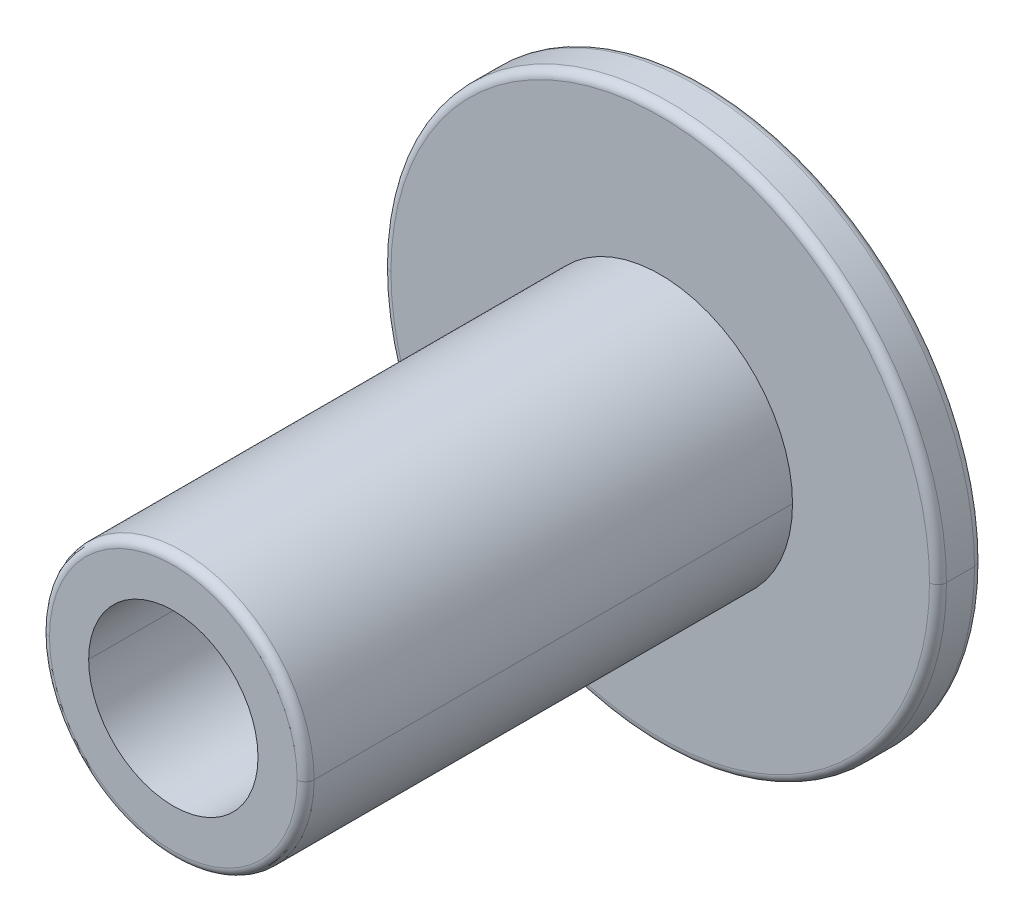
ISO-10303-21;
HEADER;
FILE_DESCRIPTION(('STEP AP214'),'2;1');
FILE_NAME('part.step','',(''),(''),'','','');
FILE_SCHEMA(('AUTOMOTIVE_DESIGN { 1 0 10303 214 1 1 1 1 }'));
ENDSEC;
DATA;
#1=APPLICATION_CONTEXT('core data for automotive mechanical design processes');
#2=APPLICATION_PROTOCOL_DEFINITION('international standard','automotive_design',2000,#1);
#3=PRODUCT_CONTEXT('',#1,'mechanical');
#4=PRODUCT('Part','Part','',(#3));
#5=PRODUCT_RELATED_PRODUCT_CATEGORY('part','',(#4));
#6=PRODUCT_DEFINITION_FORMATION('','',#4);
#7=PRODUCT_DEFINITION_CONTEXT('part definition',#1,'design');
#8=PRODUCT_DEFINITION('design','',#6,#7);
#9=PRODUCT_DEFINITION_SHAPE('','',#8);
#10=(LENGTH_UNIT() NAMED_UNIT(*) SI_UNIT(.MILLI.,.METRE.));
#11=(NAMED_UNIT(*) PLANE_ANGLE_UNIT() SI_UNIT($,.RADIAN.));
#12=(NAMED_UNIT(*) SI_UNIT($,.STERADIAN.) SOLID_ANGLE_UNIT());
#13=UNCERTAINTY_MEASURE_WITH_UNIT(LENGTH_MEASURE(1.E-05),#10,'distance_accuracy_value','');
#14=(GEOMETRIC_REPRESENTATION_CONTEXT(3) GLOBAL_UNCERTAINTY_ASSIGNED_CONTEXT((#13)) GLOBAL_UNIT_ASSIGNED_CONTEXT((#10,
#11,#12)) REPRESENTATION_CONTEXT('',''));
#15=CARTESIAN_POINT('',(0.,0.,0.));
#16=DIRECTION('',(0.,0.,1.));
#17=DIRECTION('',(1.,0.,0.));
#18=AXIS2_PLACEMENT_3D('',#15,#16,#17);
#19=CARTESIAN_POINT('',(4.55191440096314E-12,-6.10622663543836E-13,1.58750000000153));
#20=DIRECTION('',(0.,0.,-1.));
#21=DIRECTION('',(-1.,0.,0.));
#22=AXIS2_PLACEMENT_3D('',#19,#20,#21);
#23=TOROIDAL_SURFACE('',#22,2.24094461987932,1.5875);
#24=CARTESIAN_POINT('',(3.5527136788005E-12,-2.58126853225349E-12,0.108811457704222));
#25=DIRECTION('',(0.,0.,1.));
#26=DIRECTION('',(-1.,-9.11215547461094E-13,0.));
#27=AXIS2_PLACEMENT_3D('',#24,#25,#26);
#28=CIRCLE('',#27,2.81855733171483);
#29=CARTESIAN_POINT('',(2.81855733171838,0.,0.10881145770423));
#30=VERTEX_POINT('',#29);
#31=CARTESIAN_POINT('',(-2.81855733171128,0.,0.108811457704214));
#32=VERTEX_POINT('',#31);
#33=EDGE_CURVE('E162',#30,#32,#28,.T.);
#34=ORIENTED_EDGE('',*,*,#33,.F.);
#35=CARTESIAN_POINT('',(2.24094461988388,-6.2241477630067E-13,1.58750000000152));
#36=DIRECTION('',(0.,1.,0.));
#37=DIRECTION('',(-1.,0.,0.));
#38=AXIS2_PLACEMENT_3D('',#35,#36,#37);
#39=CIRCLE('',#38,1.5875);
#40=CARTESIAN_POINT('',(2.24094461987932,-6.20700563749015E-13,0.));
#41=VERTEX_POINT('',#40);
#42=EDGE_CURVE('E11',#30,#41,#39,.T.);
#43=ORIENTED_EDGE('',*,*,#42,.T.);
#44=CARTESIAN_POINT('',(0.,0.,0.));
#45=DIRECTION('',(0.,0.,-1.));
#46=DIRECTION('',(-1.,0.,0.));
#47=AXIS2_PLACEMENT_3D('',#44,#45,#46);
#48=CIRCLE('',#47,2.24094461987933);
#49=CARTESIAN_POINT('',(-2.24094461987933,0.,0.));
#50=VERTEX_POINT('',#49);
#51=EDGE_CURVE('E20',#50,#41,#48,.T.);
#52=ORIENTED_EDGE('',*,*,#51,.F.);
#53=CARTESIAN_POINT('',(-2.24094461987478,-5.98556114221422E-13,1.58750000000154));
#54=DIRECTION('',(0.,-1.,0.));
#55=DIRECTION('',(1.,0.,0.));
#56=AXIS2_PLACEMENT_3D('',#53,#54,#55);
#57=CIRCLE('',#56,1.5875);
#58=EDGE_CURVE('E232',#32,#50,#57,.T.);
#59=ORIENTED_EDGE('',*,*,#58,.F.);
#60=EDGE_LOOP('',(#34,#43,#52,#59));
#61=FACE_BOUND('',#60,.T.);
#62=ADVANCED_FACE('F16',(#61),#23,.T.);
#63=CARTESIAN_POINT('',(3.5527136788005E-12,-2.83106871279415E-12,0.721736105630408));
#64=DIRECTION('',(0.,0.,1.));
#65=DIRECTION('',(1.,0.,0.));
#66=AXIS2_PLACEMENT_3D('',#63,#64,#65);
#67=TOROIDAL_SURFACE('',#66,4.0386,0.127);
#68=CARTESIAN_POINT('',(3.66373598126302E-12,-1.38777878078145E-12,0.603441022247617));
#69=DIRECTION('',(0.,0.,-1.));
#70=DIRECTION('',(-1.,0.,0.));
#71=AXIS2_PLACEMENT_3D('',#68,#69,#70);
#72=CIRCLE('',#71,4.08480901694686);
#73=CARTESIAN_POINT('',(-4.08480901695387,0.,0.603441022247605));
#74=VERTEX_POINT('',#73);
#75=CARTESIAN_POINT('',(4.08480901695398,0.,0.603441022247628));
#76=VERTEX_POINT('',#75);
#77=EDGE_CURVE('E165',#74,#76,#72,.T.);
#78=ORIENTED_EDGE('',*,*,#77,.F.);
#79=CARTESIAN_POINT('',(-4.03859999999646,-2.80882795540768E-12,0.721736105630418));
#80=DIRECTION('',(0.,1.,0.));
#81=DIRECTION('',(-1.,0.,0.));
#82=AXIS2_PLACEMENT_3D('',#79,#80,#81);
#83=CIRCLE('',#82,0.127);
#84=CARTESIAN_POINT('',(-4.16559999999645,-8.44283687993035E-13,0.721736105630396));
#85=VERTEX_POINT('',#84);
#86=EDGE_CURVE('E27',#74,#85,#83,.T.);
#87=ORIENTED_EDGE('',*,*,#86,.T.);
#88=CARTESIAN_POINT('',(3.5527136788005E-12,-2.83106871279415E-12,0.721736105630408));
#89=DIRECTION('',(0.,0.,1.));
#90=DIRECTION('',(1.,0.,0.));
#91=AXIS2_PLACEMENT_3D('',#88,#89,#90);
#92=CIRCLE('',#91,4.1656);
#93=CARTESIAN_POINT('',(4.16560000000356,-8.88633575927774E-13,0.721736105630419));
#94=VERTEX_POINT('',#93);
#95=EDGE_CURVE('E141',#94,#85,#92,.T.);
#96=ORIENTED_EDGE('',*,*,#95,.F.);
#97=CARTESIAN_POINT('',(4.03860000000356,-2.85281488432432E-12,0.721736105630397));
#98=DIRECTION('',(0.,-1.,0.));
#99=DIRECTION('',(1.,0.,0.));
#100=AXIS2_PLACEMENT_3D('',#97,#98,#99);
#101=CIRCLE('',#100,0.127);
#102=EDGE_CURVE('E228',#76,#94,#101,.T.);
#103=ORIENTED_EDGE('',*,*,#102,.F.);
#104=EDGE_LOOP('',(#78,#87,#96,#103));
#105=FACE_BOUND('',#104,.T.);
#106=ADVANCED_FACE('F293',(#105),#67,.T.);
#107=CARTESIAN_POINT('',(2.66453525910038E-12,-2.99760216648793E-12,1.14300000000254));
#108=DIRECTION('',(0.,0.,1.));
#109=DIRECTION('',(1.,0.,0.));
#110=AXIS2_PLACEMENT_3D('',#107,#108,#109);
#111=TOROIDAL_SURFACE('',#110,4.0386,0.127);
#112=CARTESIAN_POINT('',(2.66453525910038E-12,-2.99760216648793E-12,1.14300000000254));
#113=DIRECTION('',(0.,0.,-1.));
#114=DIRECTION('',(1.,-5.16975351416703E-13,0.));
#115=AXIS2_PLACEMENT_3D('',#112,#113,#114);
#116=CIRCLE('',#115,4.1656);
#117=CARTESIAN_POINT('',(-4.16559999999734,-8.4428368799252E-13,1.14300000000253));
#118=VERTEX_POINT('',#117);
#119=CARTESIAN_POINT('',(4.16560000000267,-8.88633575928028E-13,1.14300000000256));
#120=VERTEX_POINT('',#119);
#121=EDGE_CURVE('E120',#118,#120,#116,.T.);
#122=ORIENTED_EDGE('',*,*,#121,.F.);
#123=CARTESIAN_POINT('',(-4.03859999999735,-2.97536140910145E-12,1.14300000000256));
#124=DIRECTION('',(0.,1.,0.));
#125=DIRECTION('',(-1.,0.,0.));
#126=AXIS2_PLACEMENT_3D('',#123,#124,#125);
#127=CIRCLE('',#126,0.127);
#128=CARTESIAN_POINT('',(-4.03859999999739,-2.97514566006296E-12,1.2700000000022));
#129=VERTEX_POINT('',#128);
#130=EDGE_CURVE('E117',#118,#129,#127,.T.);
#131=ORIENTED_EDGE('',*,*,#130,.T.);
#132=CARTESIAN_POINT('',(2.60902410786912E-12,-1.55431223447522E-12,1.27000000000221));
#133=DIRECTION('',(0.,0.,1.));
#134=DIRECTION('',(1.,0.,0.));
#135=AXIS2_PLACEMENT_3D('',#132,#133,#134);
#136=CIRCLE('',#135,4.0386);
#137=CARTESIAN_POINT('',(4.03860000000262,-1.57605840600539E-12,1.2700000000022));
#138=VERTEX_POINT('',#137);
#139=EDGE_CURVE('E106',#138,#129,#136,.T.);
#140=ORIENTED_EDGE('',*,*,#139,.F.);
#141=CARTESIAN_POINT('',(4.03860000000267,-3.01934833801809E-12,1.14300000000253));
#142=DIRECTION('',(0.,-1.,0.));
#143=DIRECTION('',(1.,0.,0.));
#144=AXIS2_PLACEMENT_3D('',#141,#142,#143);
#145=CIRCLE('',#144,0.127);
#146=EDGE_CURVE('E128',#120,#138,#145,.T.);
#147=ORIENTED_EDGE('',*,*,#146,.F.);
#148=EDGE_LOOP('',(#122,#131,#140,#147));
#149=FACE_BOUND('',#148,.T.);
#150=ADVANCED_FACE('F118',(#149),#111,.T.);
#151=CARTESIAN_POINT('',(4.77395900588817E-12,-2.66453525910038E-12,8.44550000000213));
#152=DIRECTION('',(0.,0.,1.));
#153=DIRECTION('',(1.,0.,0.));
#154=AXIS2_PLACEMENT_3D('',#151,#152,#153);
#155=TOROIDAL_SURFACE('',#154,1.857375,0.127);
#156=CARTESIAN_POINT('',(4.77395900588817E-12,-2.66453525910038E-12,8.44550000000213));
#157=DIRECTION('',(0.,0.,-1.));
#158=DIRECTION('',(1.,-9.06885677665056E-13,0.));
#159=AXIS2_PLACEMENT_3D('',#156,#157,#158);
#160=CIRCLE('',#159,1.984375);
#161=CARTESIAN_POINT('',(-1.98437499999523,-8.64308965840754E-13,8.44550000000213));
#162=VERTEX_POINT('',#161);
#163=CARTESIAN_POINT('',(1.98437500000477,-8.8543600849238E-13,8.44550000000214));
#164=VERTEX_POINT('',#163);
#165=EDGE_CURVE('E153',#162,#164,#160,.T.);
#166=ORIENTED_EDGE('',*,*,#165,.F.);
#167=CARTESIAN_POINT('',(-1.85737499999523,-2.65430660888726E-12,8.44550000000214));
#168=DIRECTION('',(0.,1.,0.));
#169=DIRECTION('',(-1.,0.,0.));
#170=AXIS2_PLACEMENT_3D('',#167,#168,#169);
#171=CIRCLE('',#170,0.127);
#172=CARTESIAN_POINT('',(-1.85737499999606,-2.65409085984877E-12,8.57250000000193));
#173=VERTEX_POINT('',#172);
#174=EDGE_CURVE('E125',#162,#173,#171,.T.);
#175=ORIENTED_EDGE('',*,*,#174,.T.);
#176=CARTESIAN_POINT('',(3.9412917374193E-12,-1.97064586870965E-12,8.57250000000194));
#177=DIRECTION('',(0.,0.,1.));
#178=DIRECTION('',(1.,0.,0.));
#179=AXIS2_PLACEMENT_3D('',#176,#177,#178);
#180=CIRCLE('',#179,1.857375);
#181=CARTESIAN_POINT('',(1.85737500000395,-1.98064705608792E-12,8.57250000000193));
#182=VERTEX_POINT('',#181);
#183=EDGE_CURVE('E182',#182,#173,#180,.T.);
#184=ORIENTED_EDGE('',*,*,#183,.F.);
#185=CARTESIAN_POINT('',(1.85737500000478,-2.67453644647864E-12,8.44550000000213));
#186=DIRECTION('',(0.,-1.,0.));
#187=DIRECTION('',(1.,0.,0.));
#188=AXIS2_PLACEMENT_3D('',#185,#186,#187);
#189=CIRCLE('',#188,0.127);
#190=EDGE_CURVE('E206',#164,#182,#189,.T.);
#191=ORIENTED_EDGE('',*,*,#190,.F.);
#192=EDGE_LOOP('',(#166,#175,#184,#191));
#193=FACE_BOUND('',#192,.T.);
#194=ADVANCED_FACE('F339',(#193),#155,.T.);
#195=CARTESIAN_POINT('',(5.10702591327572E-12,-7.7715611723761E-13,-41.5235806157101));
#196=DIRECTION('',(0.,0.,-1.));
#197=DIRECTION('',(-1.,0.,0.));
#198=AXIS2_PLACEMENT_3D('',#195,#196,#197);
#199=CYLINDRICAL_SURFACE('',#198,1.984375);
#200=ORIENTED_EDGE('',*,*,#165,.T.);
#201=DIRECTION('',(0.,0.,-1.));
#202=VECTOR('',#201,1.);
#203=CARTESIAN_POINT('',(1.98437500000511,-7.87598130638683E-13,-41.5235806157101));
#204=LINE('',#203,#202);
#205=CARTESIAN_POINT('',(1.98437500000261,-8.85436008492686E-13,1.27000000000222));
#206=VERTEX_POINT('',#205);
#207=EDGE_CURVE('E144',#164,#206,#204,.T.);
#208=ORIENTED_EDGE('',*,*,#207,.T.);
#209=CARTESIAN_POINT('',(2.60902410786912E-12,-1.55431223447522E-12,1.27000000000221));
#210=DIRECTION('',(0.,0.,-1.));
#211=DIRECTION('',(-1.,0.,0.));
#212=AXIS2_PLACEMENT_3D('',#209,#210,#211);
#213=CIRCLE('',#212,1.984375);
#214=CARTESIAN_POINT('',(-1.98437499999739,-1.54362720522494E-12,1.27000000000222));
#215=VERTEX_POINT('',#214);
#216=EDGE_CURVE('E130',#215,#206,#213,.T.);
#217=ORIENTED_EDGE('',*,*,#216,.F.);
#218=DIRECTION('',(0.,0.,-1.));
#219=VECTOR('',#218,1.);
#220=CARTESIAN_POINT('',(-1.9843749999949,-7.6647108798733E-13,-41.52358061571));
#221=LINE('',#220,#219);
#222=EDGE_CURVE('E217',#162,#215,#221,.T.);
#223=ORIENTED_EDGE('',*,*,#222,.F.);
#224=EDGE_LOOP('',(#200,#208,#217,#223));
#225=FACE_BOUND('',#224,.T.);
#226=ADVANCED_FACE('F336',(#225),#199,.T.);
#227=CARTESIAN_POINT('',(5.10702591327572E-12,-7.7715611723761E-13,-41.5235806157101));
#228=DIRECTION('',(0.,0.,-1.));
#229=DIRECTION('',(-1.,0.,0.));
#230=AXIS2_PLACEMENT_3D('',#227,#228,#229);
#231=CYLINDRICAL_SURFACE('',#230,4.1656);
#232=ORIENTED_EDGE('',*,*,#121,.T.);
#233=DIRECTION('',(0.,0.,-1.));
#234=VECTOR('',#233,1.);
#235=CARTESIAN_POINT('',(4.16560000000512,-7.99075991769143E-13,-41.5235806157101));
#236=LINE('',#235,#234);
#237=EDGE_CURVE('E145',#120,#94,#236,.T.);
#238=ORIENTED_EDGE('',*,*,#237,.T.);
#239=ORIENTED_EDGE('',*,*,#95,.T.);
#240=DIRECTION('',(0.,0.,-1.));
#241=VECTOR('',#240,1.);
#242=CARTESIAN_POINT('',(-4.1655999999949,-7.54726103835424E-13,-41.52358061571));
#243=LINE('',#242,#241);
#244=EDGE_CURVE('E178',#118,#85,#243,.T.);
#245=ORIENTED_EDGE('',*,*,#244,.F.);
#246=EDGE_LOOP('',(#232,#238,#239,#245));
#247=FACE_BOUND('',#246,.T.);
#248=ADVANCED_FACE('F18',(#247),#231,.T.);
#249=CARTESIAN_POINT('',(0.,0.,0.));
#250=DIRECTION('',(0.,0.,1.));
#251=DIRECTION('',(1.,0.,0.));
#252=AXIS2_PLACEMENT_3D('',#249,#250,#251);
#253=CONICAL_SURFACE('',#252,2.54,1.19839788011814);
#254=ORIENTED_EDGE('',*,*,#33,.T.);
#255=DIRECTION('',(-0.93145734947962,0.,0.363850527140475));
#256=VECTOR('',#255,1.);
#257=CARTESIAN_POINT('',(-2.54,0.,0.));
#258=LINE('',#257,#256);
#259=EDGE_CURVE('E185',#32,#74,#258,.T.);
#260=ORIENTED_EDGE('',*,*,#259,.T.);
#261=ORIENTED_EDGE('',*,*,#77,.T.);
#262=DIRECTION('',(0.931457349479621,0.,0.363850527140471));
#263=VECTOR('',#262,1.);
#264=CARTESIAN_POINT('',(2.54,0.,0.));
#265=LINE('',#264,#263);
#266=EDGE_CURVE('E42',#30,#76,#265,.T.);
#267=ORIENTED_EDGE('',*,*,#266,.F.);
#268=EDGE_LOOP('',(#254,#260,#261,#267));
#269=FACE_BOUND('',#268,.T.);
#270=ADVANCED_FACE('F315',(#269),#253,.T.);
#271=CARTESIAN_POINT('',(5.10702591327572E-12,-7.7715611723761E-13,-41.5235806157101));
#272=DIRECTION('',(0.,0.,-1.));
#273=DIRECTION('',(-1.,0.,0.));
#274=AXIS2_PLACEMENT_3D('',#271,#272,#273);
#275=CYLINDRICAL_SURFACE('',#274,1.27);
#276=CARTESIAN_POINT('',(3.9412917374193E-12,-1.97064586870965E-12,8.57250000000194));
#277=DIRECTION('',(0.,0.,-1.));
#278=DIRECTION('',(-1.,0.,0.));
#279=AXIS2_PLACEMENT_3D('',#276,#277,#278);
#280=CIRCLE('',#279,1.27);
#281=CARTESIAN_POINT('',(1.27000000000394,-8.80471348026068E-13,8.57250000000194));
#282=VERTEX_POINT('',#281);
#283=CARTESIAN_POINT('',(-1.26999999999606,-1.96380744998947E-12,8.57250000000194));
#284=VERTEX_POINT('',#283);
#285=EDGE_CURVE('E202',#282,#284,#280,.T.);
#286=ORIENTED_EDGE('',*,*,#285,.F.);
#287=DIRECTION('',(0.,0.,-1.));
#288=VECTOR('',#287,1.);
#289=CARTESIAN_POINT('',(1.27000000000511,-7.83839005814297E-13,-41.5235806157101));
#290=LINE('',#289,#288);
#291=CARTESIAN_POINT('',(1.27,-8.80471348023899E-13,0.));
#292=VERTEX_POINT('',#291);
#293=EDGE_CURVE('E167',#282,#292,#290,.T.);
#294=ORIENTED_EDGE('',*,*,#293,.T.);
#295=CARTESIAN_POINT('',(0.,0.,0.));
#296=DIRECTION('',(0.,0.,-1.));
#297=DIRECTION('',(-1.,0.,0.));
#298=AXIS2_PLACEMENT_3D('',#295,#296,#297);
#299=CIRCLE('',#298,1.27);
#300=CARTESIAN_POINT('',(-1.27,0.,0.));
#301=VERTEX_POINT('',#300);
#302=EDGE_CURVE('E171',#292,#301,#299,.T.);
#303=ORIENTED_EDGE('',*,*,#302,.T.);
#304=DIRECTION('',(0.,0.,-1.));
#305=VECTOR('',#304,1.);
#306=CARTESIAN_POINT('',(-1.2699999999949,-7.70317698517431E-13,-41.5235806157101));
#307=LINE('',#306,#305);
#308=EDGE_CURVE('E172',#284,#301,#307,.T.);
#309=ORIENTED_EDGE('',*,*,#308,.F.);
#310=EDGE_LOOP('',(#286,#294,#303,#309));
#311=FACE_BOUND('',#310,.T.);
#312=ADVANCED_FACE('F313',(#311),#275,.F.);
#313=CARTESIAN_POINT('',(5.10702591327572E-12,-7.7715611723761E-13,-41.5235806157101));
#314=DIRECTION('',(0.,0.,-1.));
#315=DIRECTION('',(-1.,0.,0.));
#316=AXIS2_PLACEMENT_3D('',#313,#314,#315);
#317=CYLINDRICAL_SURFACE('',#316,1.27);
#318=ORIENTED_EDGE('',*,*,#293,.F.);
#319=CARTESIAN_POINT('',(3.9412917374193E-12,-1.97064586870965E-12,8.57250000000194));
#320=DIRECTION('',(0.,0.,-1.));
#321=DIRECTION('',(-1.,0.,0.));
#322=AXIS2_PLACEMENT_3D('',#319,#320,#321);
#323=CIRCLE('',#322,1.27);
#324=EDGE_CURVE('E183',#284,#282,#323,.T.);
#325=ORIENTED_EDGE('',*,*,#324,.F.);
#326=ORIENTED_EDGE('',*,*,#308,.T.);
#327=CARTESIAN_POINT('',(0.,0.,0.));
#328=DIRECTION('',(0.,0.,-1.));
#329=DIRECTION('',(-1.,0.,0.));
#330=AXIS2_PLACEMENT_3D('',#327,#328,#329);
#331=CIRCLE('',#330,1.27);
#332=EDGE_CURVE('E175',#301,#292,#331,.T.);
#333=ORIENTED_EDGE('',*,*,#332,.T.);
#334=EDGE_LOOP('',(#318,#325,#326,#333));
#335=FACE_BOUND('',#334,.T.);
#336=ADVANCED_FACE('F258',(#335),#317,.F.);
#337=CARTESIAN_POINT('',(-1.26999999999694,-1.19348975147204E-12,1.56819002228304E-12));
#338=DIRECTION('',(0.,0.,-1.));
#339=DIRECTION('',(-1.,0.,0.));
#340=AXIS2_PLACEMENT_3D('',#337,#338,#339);
#341=PLANE('',#340);
#342=ORIENTED_EDGE('',*,*,#51,.T.);
#343=CARTESIAN_POINT('',(0.,0.,0.));
#344=DIRECTION('',(0.,0.,-1.));
#345=DIRECTION('',(-1.,0.,0.));
#346=AXIS2_PLACEMENT_3D('',#343,#344,#345);
#347=CIRCLE('',#346,2.24094461987933);
#348=EDGE_CURVE('E209',#41,#50,#347,.T.);
#349=ORIENTED_EDGE('',*,*,#348,.T.);
#350=EDGE_LOOP('',(#342,#349));
#351=FACE_BOUND('',#350,.T.);
#352=ORIENTED_EDGE('',*,*,#332,.F.);
#353=ORIENTED_EDGE('',*,*,#302,.F.);
#354=EDGE_LOOP('',(#352,#353));
#355=FACE_BOUND('',#354,.T.);
#356=ADVANCED_FACE('F254',(#351,#355),#341,.T.);
#357=CARTESIAN_POINT('',(0.,0.,0.));
#358=DIRECTION('',(0.,0.,1.));
#359=DIRECTION('',(1.,0.,0.));
#360=AXIS2_PLACEMENT_3D('',#357,#358,#359);
#361=CONICAL_SURFACE('',#360,2.54,1.19839788011814);
#362=ORIENTED_EDGE('',*,*,#259,.F.);
#363=CARTESIAN_POINT('',(3.5527136788005E-12,-2.58126853225349E-12,0.108811457704222));
#364=DIRECTION('',(0.,0.,1.));
#365=DIRECTION('',(-1.,0.,0.));
#366=AXIS2_PLACEMENT_3D('',#363,#364,#365);
#367=CIRCLE('',#366,2.81855733171483);
#368=EDGE_CURVE('E213',#32,#30,#367,.T.);
#369=ORIENTED_EDGE('',*,*,#368,.T.);
#370=ORIENTED_EDGE('',*,*,#266,.T.);
#371=CARTESIAN_POINT('',(3.66373598126302E-12,-1.38777878078145E-12,0.603441022247617));
#372=DIRECTION('',(0.,0.,-1.));
#373=DIRECTION('',(-1.,0.,0.));
#374=AXIS2_PLACEMENT_3D('',#371,#372,#373);
#375=CIRCLE('',#374,4.08480901694686);
#376=EDGE_CURVE('E192',#76,#74,#375,.T.);
#377=ORIENTED_EDGE('',*,*,#376,.T.);
#378=EDGE_LOOP('',(#362,#369,#370,#377));
#379=FACE_BOUND('',#378,.T.);
#380=ADVANCED_FACE('F257',(#379),#361,.T.);
#381=CARTESIAN_POINT('',(5.10702591327572E-12,-7.7715611723761E-13,-41.5235806157101));
#382=DIRECTION('',(0.,0.,-1.));
#383=DIRECTION('',(-1.,0.,0.));
#384=AXIS2_PLACEMENT_3D('',#381,#382,#383);
#385=CYLINDRICAL_SURFACE('',#384,4.1656);
#386=ORIENTED_EDGE('',*,*,#237,.F.);
#387=CARTESIAN_POINT('',(2.66453525910038E-12,-2.99760216648793E-12,1.14300000000254));
#388=DIRECTION('',(0.,0.,-1.));
#389=DIRECTION('',(1.,0.,0.));
#390=AXIS2_PLACEMENT_3D('',#387,#388,#389);
#391=CIRCLE('',#390,4.1656);
#392=EDGE_CURVE('E189',#120,#118,#391,.T.);
#393=ORIENTED_EDGE('',*,*,#392,.T.);
#394=ORIENTED_EDGE('',*,*,#244,.T.);
#395=CARTESIAN_POINT('',(3.5527136788005E-12,-2.83106871279415E-12,0.721736105630408));
#396=DIRECTION('',(0.,0.,1.));
#397=DIRECTION('',(1.,0.,0.));
#398=AXIS2_PLACEMENT_3D('',#395,#396,#397);
#399=CIRCLE('',#398,4.1656);
#400=EDGE_CURVE('E114',#85,#94,#399,.T.);
#401=ORIENTED_EDGE('',*,*,#400,.T.);
#402=EDGE_LOOP('',(#386,#393,#394,#401));
#403=FACE_BOUND('',#402,.T.);
#404=ADVANCED_FACE('F363',(#403),#385,.T.);
#405=CARTESIAN_POINT('',(-4.1655999999961,-5.55111512312578E-13,1.27000000000207));
#406=DIRECTION('',(0.,0.,1.));
#407=DIRECTION('',(1.,0.,0.));
#408=AXIS2_PLACEMENT_3D('',#405,#406,#407);
#409=PLANE('',#408);
#410=ORIENTED_EDGE('',*,*,#139,.T.);
#411=CARTESIAN_POINT('',(2.60902410786912E-12,-1.55431223447522E-12,1.27000000000221));
#412=DIRECTION('',(0.,0.,1.));
#413=DIRECTION('',(1.,0.,0.));
#414=AXIS2_PLACEMENT_3D('',#411,#412,#413);
#415=CIRCLE('',#414,4.0386);
#416=EDGE_CURVE('E111',#129,#138,#415,.T.);
#417=ORIENTED_EDGE('',*,*,#416,.T.);
#418=EDGE_LOOP('',(#410,#417));
#419=FACE_BOUND('',#418,.T.);
#420=ORIENTED_EDGE('',*,*,#216,.T.);
#421=CARTESIAN_POINT('',(2.60902410786912E-12,-1.55431223447522E-12,1.27000000000221));
#422=DIRECTION('',(0.,0.,-1.));
#423=DIRECTION('',(-1.,0.,0.));
#424=AXIS2_PLACEMENT_3D('',#421,#422,#423);
#425=CIRCLE('',#424,1.984375);
#426=EDGE_CURVE('E137',#206,#215,#425,.T.);
#427=ORIENTED_EDGE('',*,*,#426,.T.);
#428=EDGE_LOOP('',(#420,#427));
#429=FACE_BOUND('',#428,.T.);
#430=ADVANCED_FACE('F108',(#419,#429),#409,.T.);
#431=CARTESIAN_POINT('',(5.10702591327572E-12,-7.7715611723761E-13,-41.5235806157101));
#432=DIRECTION('',(0.,0.,-1.));
#433=DIRECTION('',(-1.,0.,0.));
#434=AXIS2_PLACEMENT_3D('',#431,#432,#433);
#435=CYLINDRICAL_SURFACE('',#434,1.984375);
#436=ORIENTED_EDGE('',*,*,#207,.F.);
#437=CARTESIAN_POINT('',(4.77395900588817E-12,-2.66453525910038E-12,8.44550000000213));
#438=DIRECTION('',(0.,0.,-1.));
#439=DIRECTION('',(1.,0.,0.));
#440=AXIS2_PLACEMENT_3D('',#437,#438,#439);
#441=CIRCLE('',#440,1.984375);
#442=EDGE_CURVE('E220',#164,#162,#441,.T.);
#443=ORIENTED_EDGE('',*,*,#442,.T.);
#444=ORIENTED_EDGE('',*,*,#222,.T.);
#445=ORIENTED_EDGE('',*,*,#426,.F.);
#446=EDGE_LOOP('',(#436,#443,#444,#445));
#447=FACE_BOUND('',#446,.T.);
#448=ADVANCED_FACE('F341',(#447),#435,.T.);
#449=CARTESIAN_POINT('',(-1.9843749999966,-2.94209101525667E-12,8.57250000000163));
#450=DIRECTION('',(0.,0.,1.));
#451=DIRECTION('',(1.,0.,0.));
#452=AXIS2_PLACEMENT_3D('',#449,#450,#451);
#453=PLANE('',#452);
#454=ORIENTED_EDGE('',*,*,#183,.T.);
#455=CARTESIAN_POINT('',(3.9412917374193E-12,-1.97064586870965E-12,8.57250000000194));
#456=DIRECTION('',(0.,0.,1.));
#457=DIRECTION('',(1.,0.,0.));
#458=AXIS2_PLACEMENT_3D('',#455,#456,#457);
#459=CIRCLE('',#458,1.857375);
#460=EDGE_CURVE('E179',#173,#182,#459,.T.);
#461=ORIENTED_EDGE('',*,*,#460,.T.);
#462=EDGE_LOOP('',(#454,#461));
#463=FACE_BOUND('',#462,.T.);
#464=ORIENTED_EDGE('',*,*,#324,.T.);
#465=ORIENTED_EDGE('',*,*,#285,.T.);
#466=EDGE_LOOP('',(#464,#465));
#467=FACE_BOUND('',#466,.T.);
#468=ADVANCED_FACE('F311',(#463,#467),#453,.T.);
#469=CARTESIAN_POINT('',(4.77395900588817E-12,-2.66453525910038E-12,8.44550000000213));
#470=DIRECTION('',(0.,0.,1.));
#471=DIRECTION('',(1.,0.,0.));
#472=AXIS2_PLACEMENT_3D('',#469,#470,#471);
#473=TOROIDAL_SURFACE('',#472,1.857375,0.127);
#474=ORIENTED_EDGE('',*,*,#174,.F.);
#475=ORIENTED_EDGE('',*,*,#442,.F.);
#476=ORIENTED_EDGE('',*,*,#190,.T.);
#477=ORIENTED_EDGE('',*,*,#460,.F.);
#478=EDGE_LOOP('',(#474,#475,#476,#477));
#479=FACE_BOUND('',#478,.T.);
#480=ADVANCED_FACE('F350',(#479),#473,.T.);
#481=CARTESIAN_POINT('',(2.66453525910038E-12,-2.99760216648793E-12,1.14300000000254));
#482=DIRECTION('',(0.,0.,1.));
#483=DIRECTION('',(1.,0.,0.));
#484=AXIS2_PLACEMENT_3D('',#481,#482,#483);
#485=TOROIDAL_SURFACE('',#484,4.0386,0.127);
#486=ORIENTED_EDGE('',*,*,#130,.F.);
#487=ORIENTED_EDGE('',*,*,#392,.F.);
#488=ORIENTED_EDGE('',*,*,#146,.T.);
#489=ORIENTED_EDGE('',*,*,#416,.F.);
#490=EDGE_LOOP('',(#486,#487,#488,#489));
#491=FACE_BOUND('',#490,.T.);
#492=ADVANCED_FACE('F127',(#491),#485,.T.);
#493=CARTESIAN_POINT('',(3.5527136788005E-12,-2.83106871279415E-12,0.721736105630408));
#494=DIRECTION('',(0.,0.,1.));
#495=DIRECTION('',(1.,0.,0.));
#496=AXIS2_PLACEMENT_3D('',#493,#494,#495);
#497=TOROIDAL_SURFACE('',#496,4.0386,0.127);
#498=ORIENTED_EDGE('',*,*,#86,.F.);
#499=ORIENTED_EDGE('',*,*,#376,.F.);
#500=ORIENTED_EDGE('',*,*,#102,.T.);
#501=ORIENTED_EDGE('',*,*,#400,.F.);
#502=EDGE_LOOP('',(#498,#499,#500,#501));
#503=FACE_BOUND('',#502,.T.);
#504=ADVANCED_FACE('F291',(#503),#497,.T.);
#505=CARTESIAN_POINT('',(4.55191440096314E-12,-6.10622663543836E-13,1.58750000000153));
#506=DIRECTION('',(0.,0.,-1.));
#507=DIRECTION('',(-1.,0.,0.));
#508=AXIS2_PLACEMENT_3D('',#505,#506,#507);
#509=TOROIDAL_SURFACE('',#508,2.24094461987932,1.5875);
#510=ORIENTED_EDGE('',*,*,#42,.F.);
#511=ORIENTED_EDGE('',*,*,#368,.F.);
#512=ORIENTED_EDGE('',*,*,#58,.T.);
#513=ORIENTED_EDGE('',*,*,#348,.F.);
#514=EDGE_LOOP('',(#510,#511,#512,#513));
#515=FACE_BOUND('',#514,.T.);
#516=ADVANCED_FACE('F247',(#515),#509,.T.);
#517=CLOSED_SHELL('',(#62,#106,#150,#194,#226,#248,#270,#312,#336,#356,#380,#404,#430,#448,#468,
#480,#492,#504,#516));
#518=MANIFOLD_SOLID_BREP('B1',#517);
#519=ADVANCED_BREP_SHAPE_REPRESENTATION('',(#18,#518),#14);
#520=SHAPE_DEFINITION_REPRESENTATION(#9,#519);
ENDSEC;
END-ISO-10303-21;
